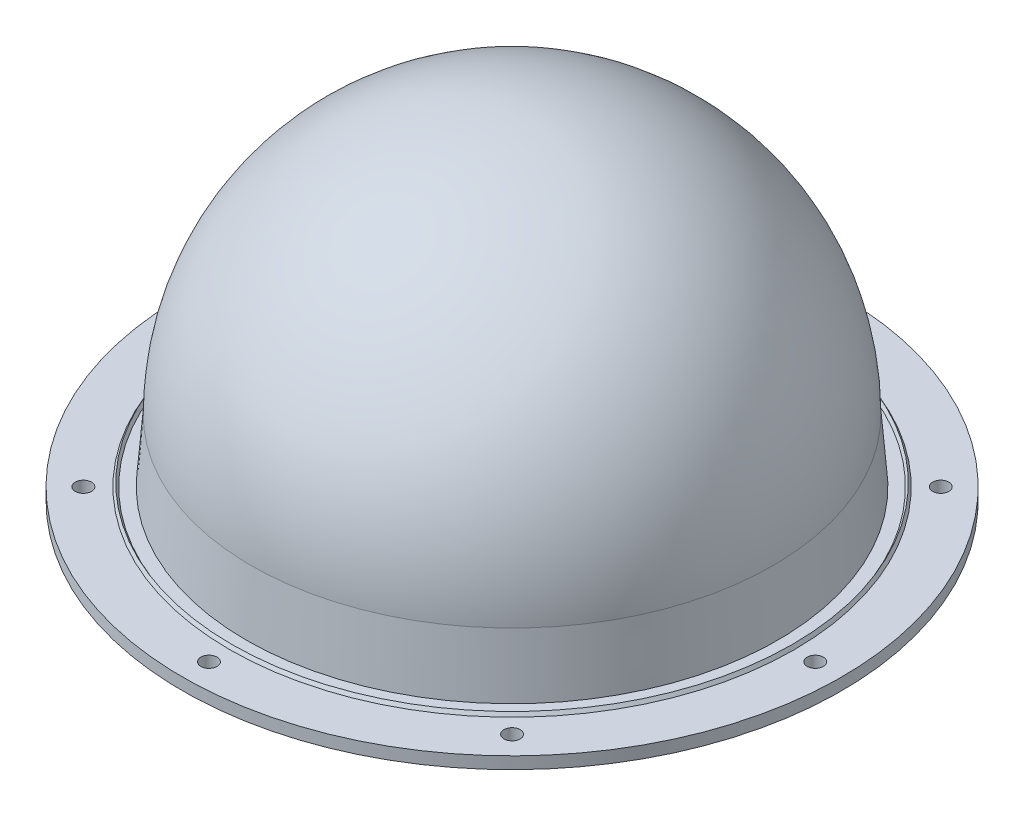
ISO-10303-21;
HEADER;
FILE_DESCRIPTION(('STEP AP214'),'2;1');
FILE_NAME('part.step','',(''),(''),'','','');
FILE_SCHEMA(('AUTOMOTIVE_DESIGN { 1 0 10303 214 1 1 1 1 }'));
ENDSEC;
DATA;
#1=APPLICATION_CONTEXT('core data for automotive mechanical design processes');
#2=APPLICATION_PROTOCOL_DEFINITION('international standard','automotive_design',2000,#1);
#3=PRODUCT_CONTEXT('',#1,'mechanical');
#4=PRODUCT('Part','Part','',(#3));
#5=PRODUCT_RELATED_PRODUCT_CATEGORY('part','',(#4));
#6=PRODUCT_DEFINITION_FORMATION('','',#4);
#7=PRODUCT_DEFINITION_CONTEXT('part definition',#1,'design');
#8=PRODUCT_DEFINITION('design','',#6,#7);
#9=PRODUCT_DEFINITION_SHAPE('','',#8);
#10=(LENGTH_UNIT() NAMED_UNIT(*) SI_UNIT(.MILLI.,.METRE.));
#11=(NAMED_UNIT(*) PLANE_ANGLE_UNIT() SI_UNIT($,.RADIAN.));
#12=(NAMED_UNIT(*) SI_UNIT($,.STERADIAN.) SOLID_ANGLE_UNIT());
#13=UNCERTAINTY_MEASURE_WITH_UNIT(LENGTH_MEASURE(1.E-05),#10,'distance_accuracy_value','');
#14=(GEOMETRIC_REPRESENTATION_CONTEXT(3) GLOBAL_UNCERTAINTY_ASSIGNED_CONTEXT((#13)) GLOBAL_UNIT_ASSIGNED_CONTEXT((#10,
#11,#12)) REPRESENTATION_CONTEXT('',''));
#15=CARTESIAN_POINT('',(0.,0.,0.));
#16=DIRECTION('',(0.,0.,1.));
#17=DIRECTION('',(1.,0.,0.));
#18=AXIS2_PLACEMENT_3D('',#15,#16,#17);
#19=CARTESIAN_POINT('',(0.,0.,0.));
#20=DIRECTION('',(0.,-1.,0.));
#21=DIRECTION('',(0.,0.,-1.));
#22=AXIS2_PLACEMENT_3D('',#19,#20,#21);
#23=CYLINDRICAL_SURFACE('',#22,93.5);
#24=CARTESIAN_POINT('',(0.,0.,0.));
#25=DIRECTION('',(0.,-1.,0.));
#26=DIRECTION('',(0.,0.,-1.));
#27=AXIS2_PLACEMENT_3D('',#24,#25,#26);
#28=CIRCLE('',#27,93.5);
#29=CARTESIAN_POINT('',(0.,0.,-93.5));
#30=VERTEX_POINT('',#29);
#31=EDGE_CURVE('E10',#30,#30,#28,.T.);
#32=ORIENTED_EDGE('',*,*,#31,.F.);
#33=EDGE_LOOP('',(#32));
#34=FACE_BOUND('',#33,.T.);
#35=CARTESIAN_POINT('',(0.,3.4,0.));
#36=DIRECTION('',(0.,-1.,0.));
#37=DIRECTION('',(0.,0.,-1.));
#38=AXIS2_PLACEMENT_3D('',#35,#36,#37);
#39=CIRCLE('',#38,93.5);
#40=CARTESIAN_POINT('',(0.,3.4,-93.5));
#41=VERTEX_POINT('',#40);
#42=EDGE_CURVE('E66',#41,#41,#39,.T.);
#43=ORIENTED_EDGE('',*,*,#42,.T.);
#44=EDGE_LOOP('',(#43));
#45=FACE_BOUND('',#44,.T.);
#46=ADVANCED_FACE('F35',(#34,#45),#23,.T.);
#47=CARTESIAN_POINT('',(0.,0.,0.));
#48=DIRECTION('',(0.,1.,0.));
#49=DIRECTION('',(0.,0.,1.));
#50=AXIS2_PLACEMENT_3D('',#47,#48,#49);
#51=PLANE('',#50);
#52=CARTESIAN_POINT('',(86.,0.,3.00267395140509E-13));
#53=DIRECTION('',(0.,1.,0.));
#54=DIRECTION('',(0.,0.,1.));
#55=AXIS2_PLACEMENT_3D('',#52,#53,#54);
#56=CIRCLE('',#55,2.3);
#57=CARTESIAN_POINT('',(86.,0.,2.3000000000003));
#58=VERTEX_POINT('',#57);
#59=EDGE_CURVE('E75',#58,#58,#56,.T.);
#60=ORIENTED_EDGE('',*,*,#59,.T.);
#61=EDGE_LOOP('',(#60));
#62=FACE_BOUND('',#61,.T.);
#63=CARTESIAN_POINT('',(60.8111831820428,0.,60.8111831820434));
#64=DIRECTION('',(0.,1.,0.));
#65=DIRECTION('',(0.,0.,1.));
#66=AXIS2_PLACEMENT_3D('',#63,#64,#65);
#67=CIRCLE('',#66,2.3);
#68=CARTESIAN_POINT('',(60.8111831820428,0.,63.1111831820434));
#69=VERTEX_POINT('',#68);
#70=EDGE_CURVE('E78',#69,#69,#67,.T.);
#71=ORIENTED_EDGE('',*,*,#70,.T.);
#72=EDGE_LOOP('',(#71));
#73=FACE_BOUND('',#72,.T.);
#74=CARTESIAN_POINT('',(0.,0.,86.));
#75=DIRECTION('',(0.,1.,0.));
#76=DIRECTION('',(0.,0.,1.));
#77=AXIS2_PLACEMENT_3D('',#74,#75,#76);
#78=CIRCLE('',#77,2.3);
#79=CARTESIAN_POINT('',(0.,0.,88.3));
#80=VERTEX_POINT('',#79);
#81=EDGE_CURVE('E81',#80,#80,#78,.T.);
#82=ORIENTED_EDGE('',*,*,#81,.T.);
#83=EDGE_LOOP('',(#82));
#84=FACE_BOUND('',#83,.T.);
#85=CARTESIAN_POINT('',(-60.8111831820436,0.,60.8111831820426));
#86=DIRECTION('',(0.,1.,0.));
#87=DIRECTION('',(0.,0.,1.));
#88=AXIS2_PLACEMENT_3D('',#85,#86,#87);
#89=CIRCLE('',#88,2.3);
#90=CARTESIAN_POINT('',(-60.8111831820436,0.,63.1111831820426));
#91=VERTEX_POINT('',#90);
#92=EDGE_CURVE('E84',#91,#91,#89,.T.);
#93=ORIENTED_EDGE('',*,*,#92,.T.);
#94=EDGE_LOOP('',(#93));
#95=FACE_BOUND('',#94,.T.);
#96=CARTESIAN_POINT('',(-86.,0.,-9.00802185421528E-13));
#97=DIRECTION('',(0.,1.,0.));
#98=DIRECTION('',(0.,0.,1.));
#99=AXIS2_PLACEMENT_3D('',#96,#97,#98);
#100=CIRCLE('',#99,2.3);
#101=CARTESIAN_POINT('',(-86.,0.,2.2999999999991));
#102=VERTEX_POINT('',#101);
#103=EDGE_CURVE('E87',#102,#102,#100,.T.);
#104=ORIENTED_EDGE('',*,*,#103,.T.);
#105=EDGE_LOOP('',(#104));
#106=FACE_BOUND('',#105,.T.);
#107=CARTESIAN_POINT('',(-60.8111831820423,0.,-60.8111831820438));
#108=DIRECTION('',(0.,1.,0.));
#109=DIRECTION('',(0.,0.,1.));
#110=AXIS2_PLACEMENT_3D('',#107,#108,#109);
#111=CIRCLE('',#110,2.3);
#112=CARTESIAN_POINT('',(-60.8111831820423,0.,-58.5111831820438));
#113=VERTEX_POINT('',#112);
#114=EDGE_CURVE('E90',#113,#113,#111,.T.);
#115=ORIENTED_EDGE('',*,*,#114,.T.);
#116=EDGE_LOOP('',(#115));
#117=FACE_BOUND('',#116,.T.);
#118=CARTESIAN_POINT('',(60.8111831820432,0.,-60.811183182043));
#119=DIRECTION('',(0.,1.,0.));
#120=DIRECTION('',(0.,0.,1.));
#121=AXIS2_PLACEMENT_3D('',#118,#119,#120);
#122=CIRCLE('',#121,2.3);
#123=CARTESIAN_POINT('',(60.8111831820432,0.,-58.511183182043));
#124=VERTEX_POINT('',#123);
#125=EDGE_CURVE('E93',#124,#124,#122,.T.);
#126=ORIENTED_EDGE('',*,*,#125,.T.);
#127=EDGE_LOOP('',(#126));
#128=FACE_BOUND('',#127,.T.);
#129=CARTESIAN_POINT('',(0.,0.,-86.));
#130=DIRECTION('',(0.,1.,0.));
#131=DIRECTION('',(0.,0.,1.));
#132=AXIS2_PLACEMENT_3D('',#129,#130,#131);
#133=CIRCLE('',#132,2.3);
#134=CARTESIAN_POINT('',(0.,0.,-83.7));
#135=VERTEX_POINT('',#134);
#136=EDGE_CURVE('E69',#135,#135,#133,.T.);
#137=ORIENTED_EDGE('',*,*,#136,.T.);
#138=EDGE_LOOP('',(#137));
#139=FACE_BOUND('',#138,.T.);
#140=CARTESIAN_POINT('',(0.,0.,0.));
#141=DIRECTION('',(0.,-1.,0.));
#142=DIRECTION('',(0.,0.,-1.));
#143=AXIS2_PLACEMENT_3D('',#140,#141,#142);
#144=CIRCLE('',#143,73.1);
#145=CARTESIAN_POINT('',(0.,0.,-73.1));
#146=VERTEX_POINT('',#145);
#147=EDGE_CURVE('E41',#146,#146,#144,.T.);
#148=ORIENTED_EDGE('',*,*,#147,.F.);
#149=EDGE_LOOP('',(#148));
#150=FACE_BOUND('',#149,.T.);
#151=ORIENTED_EDGE('',*,*,#31,.T.);
#152=EDGE_LOOP('',(#151));
#153=FACE_BOUND('',#152,.T.);
#154=ADVANCED_FACE('F149',(#62,#73,#84,#95,#106,#117,#128,#139,#150,#153),#51,.F.);
#155=CARTESIAN_POINT('',(0.,0.,0.));
#156=DIRECTION('',(0.,-1.,0.));
#157=DIRECTION('',(0.,0.,-1.));
#158=AXIS2_PLACEMENT_3D('',#155,#156,#157);
#159=CONICAL_SURFACE('',#158,73.1,0.0793783145595741);
#160=CARTESIAN_POINT('',(0.,21.,0.));
#161=DIRECTION('',(0.,-1.,0.));
#162=DIRECTION('',(0.,0.,-1.));
#163=AXIS2_PLACEMENT_3D('',#160,#161,#162);
#164=CIRCLE('',#163,71.4295454545454);
#165=CARTESIAN_POINT('',(0.,21.,-71.4295454545454));
#166=VERTEX_POINT('',#165);
#167=EDGE_CURVE('E45',#166,#166,#164,.T.);
#168=ORIENTED_EDGE('',*,*,#167,.F.);
#169=EDGE_LOOP('',(#168));
#170=FACE_BOUND('',#169,.T.);
#171=ORIENTED_EDGE('',*,*,#147,.T.);
#172=EDGE_LOOP('',(#171));
#173=FACE_BOUND('',#172,.T.);
#174=ADVANCED_FACE('F154',(#170,#173),#159,.F.);
#175=CARTESIAN_POINT('',(0.,21.,0.));
#176=DIRECTION('',(0.,-1.,0.));
#177=DIRECTION('',(-1.,0.,0.));
#178=AXIS2_PLACEMENT_3D('',#175,#176,#177);
#179=SPHERICAL_SURFACE('',#178,71.4295454545454);
#180=ORIENTED_EDGE('',*,*,#167,.T.);
#181=EDGE_LOOP('',(#180));
#182=FACE_BOUND('',#181,.T.);
#183=ADVANCED_FACE('F160',(#182),#179,.F.);
#184=CARTESIAN_POINT('',(0.,21.,0.));
#185=DIRECTION('',(0.,-1.,0.));
#186=DIRECTION('',(-1.,0.,0.));
#187=AXIS2_PLACEMENT_3D('',#184,#185,#186);
#188=SPHERICAL_SURFACE('',#187,74.);
#189=CARTESIAN_POINT('',(0.,21.,0.));
#190=DIRECTION('',(0.,-1.,0.));
#191=DIRECTION('',(0.,0.,-1.));
#192=AXIS2_PLACEMENT_3D('',#189,#190,#191);
#193=CIRCLE('',#192,74.);
#194=CARTESIAN_POINT('',(0.,21.,-74.));
#195=VERTEX_POINT('',#194);
#196=EDGE_CURVE('E49',#195,#195,#193,.T.);
#197=ORIENTED_EDGE('',*,*,#196,.F.);
#198=EDGE_LOOP('',(#197));
#199=FACE_BOUND('',#198,.T.);
#200=ADVANCED_FACE('F167',(#199),#188,.T.);
#201=CARTESIAN_POINT('',(0.,21.,0.));
#202=DIRECTION('',(0.,-1.,0.));
#203=DIRECTION('',(0.,0.,-1.));
#204=AXIS2_PLACEMENT_3D('',#201,#202,#203);
#205=CONICAL_SURFACE('',#204,74.,0.0793783145595742);
#206=CARTESIAN_POINT('',(0.,3.4,0.));
#207=DIRECTION('',(0.,-1.,0.));
#208=DIRECTION('',(0.,0.,-1.));
#209=AXIS2_PLACEMENT_3D('',#206,#207,#208);
#210=CIRCLE('',#209,75.4);
#211=CARTESIAN_POINT('',(0.,3.4,-75.4));
#212=VERTEX_POINT('',#211);
#213=EDGE_CURVE('E54',#212,#212,#210,.T.);
#214=ORIENTED_EDGE('',*,*,#213,.F.);
#215=EDGE_LOOP('',(#214));
#216=FACE_BOUND('',#215,.T.);
#217=ORIENTED_EDGE('',*,*,#196,.T.);
#218=EDGE_LOOP('',(#217));
#219=FACE_BOUND('',#218,.T.);
#220=ADVANCED_FACE('F171',(#216,#219),#205,.T.);
#221=CARTESIAN_POINT('',(0.,3.4,0.));
#222=DIRECTION('',(0.,-1.,0.));
#223=DIRECTION('',(0.,0.,-1.));
#224=AXIS2_PLACEMENT_3D('',#221,#222,#223);
#225=PLANE('',#224);
#226=CARTESIAN_POINT('',(0.,3.4,0.));
#227=DIRECTION('',(0.,-1.,0.));
#228=DIRECTION('',(0.,0.,-1.));
#229=AXIS2_PLACEMENT_3D('',#226,#227,#228);
#230=CIRCLE('',#229,78.9226497308104);
#231=CARTESIAN_POINT('',(0.,3.4,-78.9226497308104));
#232=VERTEX_POINT('',#231);
#233=EDGE_CURVE('E57',#232,#232,#230,.T.);
#234=ORIENTED_EDGE('',*,*,#233,.F.);
#235=EDGE_LOOP('',(#234));
#236=FACE_BOUND('',#235,.T.);
#237=ORIENTED_EDGE('',*,*,#213,.T.);
#238=EDGE_LOOP('',(#237));
#239=FACE_BOUND('',#238,.T.);
#240=ADVANCED_FACE('F128',(#236,#239),#225,.F.);
#241=CARTESIAN_POINT('',(0.,4.4,0.));
#242=DIRECTION('',(0.,1.,0.));
#243=DIRECTION('',(0.,0.,1.));
#244=AXIS2_PLACEMENT_3D('',#241,#242,#243);
#245=CONICAL_SURFACE('',#244,79.5,0.523598775598313);
#246=ORIENTED_EDGE('',*,*,#233,.T.);
#247=EDGE_LOOP('',(#246));
#248=FACE_BOUND('',#247,.T.);
#249=CARTESIAN_POINT('',(0.,4.4,0.));
#250=DIRECTION('',(0.,-1.,0.));
#251=DIRECTION('',(0.,0.,-1.));
#252=AXIS2_PLACEMENT_3D('',#249,#250,#251);
#253=CIRCLE('',#252,79.5);
#254=CARTESIAN_POINT('',(0.,4.4,-79.5));
#255=VERTEX_POINT('',#254);
#256=EDGE_CURVE('E60',#255,#255,#253,.T.);
#257=ORIENTED_EDGE('',*,*,#256,.F.);
#258=EDGE_LOOP('',(#257));
#259=FACE_BOUND('',#258,.T.);
#260=ADVANCED_FACE('F140',(#248,#259),#245,.F.);
#261=CARTESIAN_POINT('',(0.,3.4,0.));
#262=DIRECTION('',(0.,-1.,0.));
#263=DIRECTION('',(0.,0.,-1.));
#264=AXIS2_PLACEMENT_3D('',#261,#262,#263);
#265=CONICAL_SURFACE('',#264,80.0773502691897,0.523598775598302);
#266=ORIENTED_EDGE('',*,*,#256,.T.);
#267=EDGE_LOOP('',(#266));
#268=FACE_BOUND('',#267,.T.);
#269=CARTESIAN_POINT('',(0.,3.4,0.));
#270=DIRECTION('',(0.,-1.,0.));
#271=DIRECTION('',(0.,0.,-1.));
#272=AXIS2_PLACEMENT_3D('',#269,#270,#271);
#273=CIRCLE('',#272,80.0773502691897);
#274=CARTESIAN_POINT('',(0.,3.4,-80.0773502691897));
#275=VERTEX_POINT('',#274);
#276=EDGE_CURVE('E63',#275,#275,#273,.T.);
#277=ORIENTED_EDGE('',*,*,#276,.F.);
#278=EDGE_LOOP('',(#277));
#279=FACE_BOUND('',#278,.T.);
#280=ADVANCED_FACE('F125',(#268,#279),#265,.T.);
#281=CARTESIAN_POINT('',(86.,3.4,3.00267395140509E-13));
#282=DIRECTION('',(0.,1.,0.));
#283=DIRECTION('',(-1.,0.,0.));
#284=AXIS2_PLACEMENT_3D('',#281,#282,#283);
#285=CIRCLE('',#284,2.3);
#286=CARTESIAN_POINT('',(83.7,3.4,2.9223698806117E-13));
#287=VERTEX_POINT('',#286);
#288=EDGE_CURVE('E99',#287,#287,#285,.T.);
#289=ORIENTED_EDGE('',*,*,#288,.F.);
#290=EDGE_LOOP('',(#289));
#291=FACE_BOUND('',#290,.T.);
#292=CARTESIAN_POINT('',(60.8111831820428,3.4,60.8111831820434));
#293=DIRECTION('',(0.,1.,0.));
#294=DIRECTION('',(-0.707106781186544,0.,-0.707106781186551));
#295=AXIS2_PLACEMENT_3D('',#292,#293,#294);
#296=CIRCLE('',#295,2.3);
#297=CARTESIAN_POINT('',(59.1848375853137,3.4,59.1848375853143));
#298=VERTEX_POINT('',#297);
#299=EDGE_CURVE('E107',#298,#298,#296,.T.);
#300=ORIENTED_EDGE('',*,*,#299,.F.);
#301=EDGE_LOOP('',(#300));
#302=FACE_BOUND('',#301,.T.);
#303=CARTESIAN_POINT('',(0.,3.4,86.));
#304=DIRECTION('',(0.,1.,0.));
#305=DIRECTION('',(0.,0.,-1.));
#306=AXIS2_PLACEMENT_3D('',#303,#304,#305);
#307=CIRCLE('',#306,2.3);
#308=CARTESIAN_POINT('',(0.,3.4,83.7));
#309=VERTEX_POINT('',#308);
#310=EDGE_CURVE('E103',#309,#309,#307,.T.);
#311=ORIENTED_EDGE('',*,*,#310,.F.);
#312=EDGE_LOOP('',(#311));
#313=FACE_BOUND('',#312,.T.);
#314=CARTESIAN_POINT('',(-60.8111831820436,3.4,60.8111831820426));
#315=DIRECTION('',(0.,1.,0.));
#316=DIRECTION('',(0.707106781186554,0.,-0.707106781186541));
#317=AXIS2_PLACEMENT_3D('',#314,#315,#316);
#318=CIRCLE('',#317,2.3);
#319=CARTESIAN_POINT('',(-59.1848375853145,3.4,59.1848375853135));
#320=VERTEX_POINT('',#319);
#321=EDGE_CURVE('E100',#320,#320,#318,.T.);
#322=ORIENTED_EDGE('',*,*,#321,.F.);
#323=EDGE_LOOP('',(#322));
#324=FACE_BOUND('',#323,.T.);
#325=CARTESIAN_POINT('',(-86.,3.4,-9.00802185421528E-13));
#326=DIRECTION('',(0.,1.,0.));
#327=DIRECTION('',(1.,0.,0.));
#328=AXIS2_PLACEMENT_3D('',#325,#326,#327);
#329=CIRCLE('',#328,2.3);
#330=CARTESIAN_POINT('',(-83.7,3.4,-8.76710964183511E-13));
#331=VERTEX_POINT('',#330);
#332=EDGE_CURVE('E104',#331,#331,#329,.T.);
#333=ORIENTED_EDGE('',*,*,#332,.F.);
#334=EDGE_LOOP('',(#333));
#335=FACE_BOUND('',#334,.T.);
#336=CARTESIAN_POINT('',(-60.8111831820423,3.4,-60.8111831820438));
#337=DIRECTION('',(0.,1.,0.));
#338=DIRECTION('',(0.707106781186539,0.,0.707106781186556));
#339=AXIS2_PLACEMENT_3D('',#336,#337,#338);
#340=CIRCLE('',#339,2.3);
#341=CARTESIAN_POINT('',(-59.1848375853133,3.4,-59.1848375853147));
#342=VERTEX_POINT('',#341);
#343=EDGE_CURVE('E112',#342,#342,#340,.T.);
#344=ORIENTED_EDGE('',*,*,#343,.F.);
#345=EDGE_LOOP('',(#344));
#346=FACE_BOUND('',#345,.T.);
#347=CARTESIAN_POINT('',(60.8111831820432,3.4,-60.811183182043));
#348=DIRECTION('',(0.,1.,0.));
#349=DIRECTION('',(-0.707106781186549,0.,0.707106781186546));
#350=AXIS2_PLACEMENT_3D('',#347,#348,#349);
#351=CIRCLE('',#350,2.3);
#352=CARTESIAN_POINT('',(59.1848375853141,3.4,-59.1848375853139));
#353=VERTEX_POINT('',#352);
#354=EDGE_CURVE('E96',#353,#353,#351,.T.);
#355=ORIENTED_EDGE('',*,*,#354,.F.);
#356=EDGE_LOOP('',(#355));
#357=FACE_BOUND('',#356,.T.);
#358=CARTESIAN_POINT('',(0.,3.4,-86.));
#359=DIRECTION('',(0.,1.,0.));
#360=DIRECTION('',(0.,0.,1.));
#361=AXIS2_PLACEMENT_3D('',#358,#359,#360);
#362=CIRCLE('',#361,2.3);
#363=CARTESIAN_POINT('',(0.,3.4,-83.7));
#364=VERTEX_POINT('',#363);
#365=EDGE_CURVE('E72',#364,#364,#362,.T.);
#366=ORIENTED_EDGE('',*,*,#365,.F.);
#367=EDGE_LOOP('',(#366));
#368=FACE_BOUND('',#367,.T.);
#369=ORIENTED_EDGE('',*,*,#42,.F.);
#370=EDGE_LOOP('',(#369));
#371=FACE_BOUND('',#370,.T.);
#372=ORIENTED_EDGE('',*,*,#276,.T.);
#373=EDGE_LOOP('',(#372));
#374=FACE_BOUND('',#373,.T.);
#375=ADVANCED_FACE('F121',(#291,#302,#313,#324,#335,#346,#357,#368,#371,#374),#225,.F.);
#376=CARTESIAN_POINT('',(0.,-6.6,-86.));
#377=DIRECTION('',(0.,1.,0.));
#378=DIRECTION('',(0.,0.,1.));
#379=AXIS2_PLACEMENT_3D('',#376,#377,#378);
#380=CYLINDRICAL_SURFACE('',#379,2.3);
#381=ORIENTED_EDGE('',*,*,#365,.T.);
#382=EDGE_LOOP('',(#381));
#383=FACE_BOUND('',#382,.T.);
#384=ORIENTED_EDGE('',*,*,#136,.F.);
#385=EDGE_LOOP('',(#384));
#386=FACE_BOUND('',#385,.T.);
#387=ADVANCED_FACE('F124',(#383,#386),#380,.F.);
#388=CARTESIAN_POINT('',(60.8111831820432,-6.6,-60.811183182043));
#389=DIRECTION('',(0.,1.,0.));
#390=DIRECTION('',(0.,0.,1.));
#391=AXIS2_PLACEMENT_3D('',#388,#389,#390);
#392=CYLINDRICAL_SURFACE('',#391,2.3);
#393=ORIENTED_EDGE('',*,*,#354,.T.);
#394=EDGE_LOOP('',(#393));
#395=FACE_BOUND('',#394,.T.);
#396=ORIENTED_EDGE('',*,*,#125,.F.);
#397=EDGE_LOOP('',(#396));
#398=FACE_BOUND('',#397,.T.);
#399=ADVANCED_FACE('F189',(#395,#398),#392,.F.);
#400=CARTESIAN_POINT('',(-60.8111831820423,-6.6,-60.8111831820438));
#401=DIRECTION('',(0.,1.,0.));
#402=DIRECTION('',(0.,0.,1.));
#403=AXIS2_PLACEMENT_3D('',#400,#401,#402);
#404=CYLINDRICAL_SURFACE('',#403,2.3);
#405=ORIENTED_EDGE('',*,*,#343,.T.);
#406=EDGE_LOOP('',(#405));
#407=FACE_BOUND('',#406,.T.);
#408=ORIENTED_EDGE('',*,*,#114,.F.);
#409=EDGE_LOOP('',(#408));
#410=FACE_BOUND('',#409,.T.);
#411=ADVANCED_FACE('F193',(#407,#410),#404,.F.);
#412=CARTESIAN_POINT('',(-86.,-6.6,-9.00802185421528E-13));
#413=DIRECTION('',(0.,1.,0.));
#414=DIRECTION('',(0.,0.,1.));
#415=AXIS2_PLACEMENT_3D('',#412,#413,#414);
#416=CYLINDRICAL_SURFACE('',#415,2.3);
#417=ORIENTED_EDGE('',*,*,#332,.T.);
#418=EDGE_LOOP('',(#417));
#419=FACE_BOUND('',#418,.T.);
#420=ORIENTED_EDGE('',*,*,#103,.F.);
#421=EDGE_LOOP('',(#420));
#422=FACE_BOUND('',#421,.T.);
#423=ADVANCED_FACE('F118',(#419,#422),#416,.F.);
#424=CARTESIAN_POINT('',(-60.8111831820436,-6.6,60.8111831820426));
#425=DIRECTION('',(0.,1.,0.));
#426=DIRECTION('',(0.,0.,1.));
#427=AXIS2_PLACEMENT_3D('',#424,#425,#426);
#428=CYLINDRICAL_SURFACE('',#427,2.3);
#429=ORIENTED_EDGE('',*,*,#321,.T.);
#430=EDGE_LOOP('',(#429));
#431=FACE_BOUND('',#430,.T.);
#432=ORIENTED_EDGE('',*,*,#92,.F.);
#433=EDGE_LOOP('',(#432));
#434=FACE_BOUND('',#433,.T.);
#435=ADVANCED_FACE('F195',(#431,#434),#428,.F.);
#436=CARTESIAN_POINT('',(0.,-6.6,86.));
#437=DIRECTION('',(0.,1.,0.));
#438=DIRECTION('',(0.,0.,1.));
#439=AXIS2_PLACEMENT_3D('',#436,#437,#438);
#440=CYLINDRICAL_SURFACE('',#439,2.3);
#441=ORIENTED_EDGE('',*,*,#310,.T.);
#442=EDGE_LOOP('',(#441));
#443=FACE_BOUND('',#442,.T.);
#444=ORIENTED_EDGE('',*,*,#81,.F.);
#445=EDGE_LOOP('',(#444));
#446=FACE_BOUND('',#445,.T.);
#447=ADVANCED_FACE('F198',(#443,#446),#440,.F.);
#448=CARTESIAN_POINT('',(60.8111831820428,-6.6,60.8111831820434));
#449=DIRECTION('',(0.,1.,0.));
#450=DIRECTION('',(0.,0.,1.));
#451=AXIS2_PLACEMENT_3D('',#448,#449,#450);
#452=CYLINDRICAL_SURFACE('',#451,2.3);
#453=ORIENTED_EDGE('',*,*,#299,.T.);
#454=EDGE_LOOP('',(#453));
#455=FACE_BOUND('',#454,.T.);
#456=ORIENTED_EDGE('',*,*,#70,.F.);
#457=EDGE_LOOP('',(#456));
#458=FACE_BOUND('',#457,.T.);
#459=ADVANCED_FACE('F202',(#455,#458),#452,.F.);
#460=CARTESIAN_POINT('',(86.,-6.6,3.00267395140509E-13));
#461=DIRECTION('',(0.,1.,0.));
#462=DIRECTION('',(0.,0.,1.));
#463=AXIS2_PLACEMENT_3D('',#460,#461,#462);
#464=CYLINDRICAL_SURFACE('',#463,2.3);
#465=ORIENTED_EDGE('',*,*,#288,.T.);
#466=EDGE_LOOP('',(#465));
#467=FACE_BOUND('',#466,.T.);
#468=ORIENTED_EDGE('',*,*,#59,.F.);
#469=EDGE_LOOP('',(#468));
#470=FACE_BOUND('',#469,.T.);
#471=ADVANCED_FACE('F206',(#467,#470),#464,.F.);
#472=CLOSED_SHELL('',(#46,#154,#174,#183,#200,#220,#240,#260,#280,#375,#387,#399,#411,#423,#435,
#447,#459,#471));
#473=MANIFOLD_SOLID_BREP('B2',#472);
#474=ADVANCED_BREP_SHAPE_REPRESENTATION('',(#18,#473),#14);
#475=SHAPE_DEFINITION_REPRESENTATION(#9,#474);
ENDSEC;
END-ISO-10303-21;
